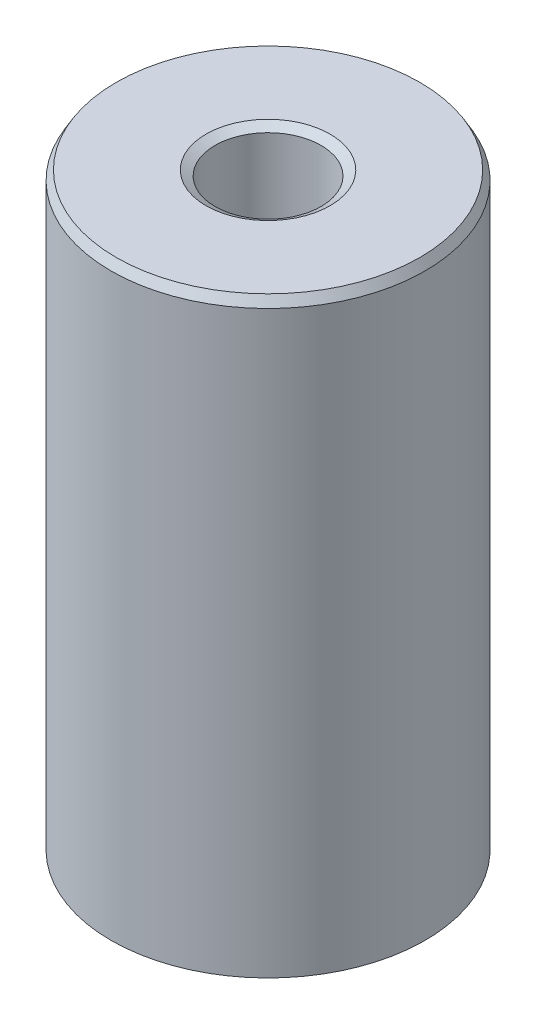
ISO-10303-21;
HEADER;
FILE_DESCRIPTION(('STEP AP214'),'2;1');
FILE_NAME('part.step','',(''),(''),'','','');
FILE_SCHEMA(('AUTOMOTIVE_DESIGN { 1 0 10303 214 1 1 1 1 }'));
ENDSEC;
DATA;
#1=APPLICATION_CONTEXT('core data for automotive mechanical design processes');
#2=APPLICATION_PROTOCOL_DEFINITION('international standard','automotive_design',2000,#1);
#3=PRODUCT_CONTEXT('',#1,'mechanical');
#4=PRODUCT('Part','Part','',(#3));
#5=PRODUCT_RELATED_PRODUCT_CATEGORY('part','',(#4));
#6=PRODUCT_DEFINITION_FORMATION('','',#4);
#7=PRODUCT_DEFINITION_CONTEXT('part definition',#1,'design');
#8=PRODUCT_DEFINITION('design','',#6,#7);
#9=PRODUCT_DEFINITION_SHAPE('','',#8);
#10=(LENGTH_UNIT() NAMED_UNIT(*) SI_UNIT(.MILLI.,.METRE.));
#11=(NAMED_UNIT(*) PLANE_ANGLE_UNIT() SI_UNIT($,.RADIAN.));
#12=(NAMED_UNIT(*) SI_UNIT($,.STERADIAN.) SOLID_ANGLE_UNIT());
#13=UNCERTAINTY_MEASURE_WITH_UNIT(LENGTH_MEASURE(1.E-05),#10,'distance_accuracy_value','');
#14=(GEOMETRIC_REPRESENTATION_CONTEXT(3) GLOBAL_UNCERTAINTY_ASSIGNED_CONTEXT((#13)) GLOBAL_UNIT_ASSIGNED_CONTEXT((#10,
#11,#12)) REPRESENTATION_CONTEXT('',''));
#15=CARTESIAN_POINT('',(0.,0.,0.));
#16=DIRECTION('',(0.,0.,1.));
#17=DIRECTION('',(1.,0.,0.));
#18=AXIS2_PLACEMENT_3D('',#15,#16,#17);
#19=CARTESIAN_POINT('',(0.,37.8421077277087,0.));
#20=DIRECTION('',(0.,-1.,0.));
#21=DIRECTION('',(0.,0.,-1.));
#22=AXIS2_PLACEMENT_3D('',#19,#20,#21);
#23=CYLINDRICAL_SURFACE('',#22,10.);
#24=CARTESIAN_POINT('',(0.,0.332499424557473,0.));
#25=DIRECTION('',(0.,1.,0.));
#26=DIRECTION('',(0.,0.,1.));
#27=AXIS2_PLACEMENT_3D('',#24,#25,#26);
#28=CIRCLE('',#27,10.);
#29=CARTESIAN_POINT('',(0.,0.332499424557473,10.));
#30=VERTEX_POINT('',#29);
#31=EDGE_CURVE('E10',#30,#30,#28,.T.);
#32=ORIENTED_EDGE('',*,*,#31,.T.);
#33=EDGE_LOOP('',(#32));
#34=FACE_BOUND('',#33,.T.);
#35=CARTESIAN_POINT('',(0.,37.2662018308877,0.));
#36=DIRECTION('',(0.,1.,0.));
#37=DIRECTION('',(0.,0.,1.));
#38=AXIS2_PLACEMENT_3D('',#35,#36,#37);
#39=CIRCLE('',#38,10.);
#40=CARTESIAN_POINT('',(0.,37.2662018308877,10.));
#41=VERTEX_POINT('',#40);
#42=EDGE_CURVE('E50',#41,#41,#39,.F.);
#43=ORIENTED_EDGE('',*,*,#42,.T.);
#44=EDGE_LOOP('',(#43));
#45=FACE_BOUND('',#44,.T.);
#46=ADVANCED_FACE('F39',(#34,#45),#23,.T.);
#47=CARTESIAN_POINT('',(0.,37.8421077277087,0.));
#48=DIRECTION('',(0.,1.,0.));
#49=DIRECTION('',(0.,0.,1.));
#50=AXIS2_PLACEMENT_3D('',#47,#48,#49);
#51=PLANE('',#50);
#52=CARTESIAN_POINT('',(0.,37.8421077277087,0.));
#53=DIRECTION('',(0.,1.,0.));
#54=DIRECTION('',(0.,0.,1.));
#55=AXIS2_PLACEMENT_3D('',#52,#53,#54);
#56=CIRCLE('',#55,3.95247798780841);
#57=CARTESIAN_POINT('',(0.,37.8421077277087,3.95247798780841));
#58=VERTEX_POINT('',#57);
#59=EDGE_CURVE('E58',#58,#58,#56,.F.);
#60=ORIENTED_EDGE('',*,*,#59,.T.);
#61=EDGE_LOOP('',(#60));
#62=FACE_BOUND('',#61,.T.);
#63=CARTESIAN_POINT('',(0.,37.8421077277087,0.));
#64=DIRECTION('',(0.,1.,0.));
#65=DIRECTION('',(0.,0.,1.));
#66=AXIS2_PLACEMENT_3D('',#63,#64,#65);
#67=CIRCLE('',#66,9.66750057544253);
#68=CARTESIAN_POINT('',(0.,37.8421077277087,9.66750057544253));
#69=VERTEX_POINT('',#68);
#70=EDGE_CURVE('E61',#69,#69,#67,.T.);
#71=ORIENTED_EDGE('',*,*,#70,.T.);
#72=EDGE_LOOP('',(#71));
#73=FACE_BOUND('',#72,.T.);
#74=ADVANCED_FACE('F88',(#62,#73),#51,.T.);
#75=CARTESIAN_POINT('',(0.,0.,0.));
#76=DIRECTION('',(0.,1.,0.));
#77=DIRECTION('',(0.,0.,1.));
#78=AXIS2_PLACEMENT_3D('',#75,#76,#77);
#79=PLANE('',#78);
#80=CARTESIAN_POINT('',(0.,0.,0.));
#81=DIRECTION('',(0.,1.,0.));
#82=DIRECTION('',(0.,0.,1.));
#83=AXIS2_PLACEMENT_3D('',#80,#81,#82);
#84=CIRCLE('',#83,3.70907151554493);
#85=CARTESIAN_POINT('',(0.,0.,3.70907151554493));
#86=VERTEX_POINT('',#85);
#87=EDGE_CURVE('E51',#86,#86,#84,.T.);
#88=ORIENTED_EDGE('',*,*,#87,.T.);
#89=EDGE_LOOP('',(#88));
#90=FACE_BOUND('',#89,.T.);
#91=CARTESIAN_POINT('',(0.,0.,0.));
#92=DIRECTION('',(0.,1.,0.));
#93=DIRECTION('',(0.,0.,1.));
#94=AXIS2_PLACEMENT_3D('',#91,#92,#93);
#95=CIRCLE('',#94,9.42409410317905);
#96=CARTESIAN_POINT('',(0.,0.,9.42409410317905));
#97=VERTEX_POINT('',#96);
#98=EDGE_CURVE('E54',#97,#97,#95,.F.);
#99=ORIENTED_EDGE('',*,*,#98,.T.);
#100=EDGE_LOOP('',(#99));
#101=FACE_BOUND('',#100,.T.);
#102=ADVANCED_FACE('F83',(#90,#101),#79,.F.);
#103=CARTESIAN_POINT('',(0.,37.8421077277087,0.));
#104=DIRECTION('',(0.,-1.,0.));
#105=DIRECTION('',(0.,0.,-1.));
#106=AXIS2_PLACEMENT_3D('',#103,#104,#105);
#107=CYLINDRICAL_SURFACE('',#106,3.37657209098747);
#108=CARTESIAN_POINT('',(0.,37.5096083031512,0.));
#109=DIRECTION('',(0.,1.,0.));
#110=DIRECTION('',(0.,0.,1.));
#111=AXIS2_PLACEMENT_3D('',#108,#109,#110);
#112=CIRCLE('',#111,3.37657209098747);
#113=CARTESIAN_POINT('',(0.,37.5096083031512,3.37657209098747));
#114=VERTEX_POINT('',#113);
#115=EDGE_CURVE('E67',#114,#114,#112,.T.);
#116=ORIENTED_EDGE('',*,*,#115,.T.);
#117=EDGE_LOOP('',(#116));
#118=FACE_BOUND('',#117,.T.);
#119=CARTESIAN_POINT('',(0.,0.575905896820945,0.));
#120=DIRECTION('',(0.,1.,0.));
#121=DIRECTION('',(0.,0.,1.));
#122=AXIS2_PLACEMENT_3D('',#119,#120,#121);
#123=CIRCLE('',#122,3.37657209098747);
#124=CARTESIAN_POINT('',(0.,0.575905896820945,3.37657209098747));
#125=VERTEX_POINT('',#124);
#126=EDGE_CURVE('E69',#125,#125,#123,.F.);
#127=ORIENTED_EDGE('',*,*,#126,.T.);
#128=EDGE_LOOP('',(#127));
#129=FACE_BOUND('',#128,.T.);
#130=ADVANCED_FACE('F71',(#118,#129),#107,.F.);
#131=CARTESIAN_POINT('',(0.,37.5096083031512,0.));
#132=DIRECTION('',(0.,1.,0.));
#133=DIRECTION('',(0.,0.,1.));
#134=AXIS2_PLACEMENT_3D('',#131,#132,#133);
#135=CONICAL_SURFACE('',#134,3.37657209098747,1.0471975511966);
#136=ORIENTED_EDGE('',*,*,#59,.F.);
#137=EDGE_LOOP('',(#136));
#138=FACE_BOUND('',#137,.T.);
#139=ORIENTED_EDGE('',*,*,#115,.F.);
#140=EDGE_LOOP('',(#139));
#141=FACE_BOUND('',#140,.T.);
#142=ADVANCED_FACE('F77',(#138,#141),#135,.F.);
#143=CARTESIAN_POINT('',(0.,0.,0.));
#144=DIRECTION('',(0.,-1.,0.));
#145=DIRECTION('',(0.,0.,-1.));
#146=AXIS2_PLACEMENT_3D('',#143,#144,#145);
#147=CONICAL_SURFACE('',#146,3.70907151554493,0.523598775598299);
#148=ORIENTED_EDGE('',*,*,#126,.F.);
#149=EDGE_LOOP('',(#148));
#150=FACE_BOUND('',#149,.T.);
#151=ORIENTED_EDGE('',*,*,#87,.F.);
#152=EDGE_LOOP('',(#151));
#153=FACE_BOUND('',#152,.T.);
#154=ADVANCED_FACE('F73',(#150,#153),#147,.F.);
#155=CARTESIAN_POINT('',(0.,0.332499424557473,0.));
#156=DIRECTION('',(0.,1.,0.));
#157=DIRECTION('',(0.,0.,1.));
#158=AXIS2_PLACEMENT_3D('',#155,#156,#157);
#159=CONICAL_SURFACE('',#158,10.,1.04719755119659);
#160=ORIENTED_EDGE('',*,*,#98,.F.);
#161=EDGE_LOOP('',(#160));
#162=FACE_BOUND('',#161,.T.);
#163=ORIENTED_EDGE('',*,*,#31,.F.);
#164=EDGE_LOOP('',(#163));
#165=FACE_BOUND('',#164,.T.);
#166=ADVANCED_FACE('F76',(#162,#165),#159,.T.);
#167=CARTESIAN_POINT('',(0.,37.8421077277087,0.));
#168=DIRECTION('',(0.,-1.,0.));
#169=DIRECTION('',(0.,0.,-1.));
#170=AXIS2_PLACEMENT_3D('',#167,#168,#169);
#171=CONICAL_SURFACE('',#170,9.66750057544253,0.523598775598293);
#172=ORIENTED_EDGE('',*,*,#42,.F.);
#173=EDGE_LOOP('',(#172));
#174=FACE_BOUND('',#173,.T.);
#175=ORIENTED_EDGE('',*,*,#70,.F.);
#176=EDGE_LOOP('',(#175));
#177=FACE_BOUND('',#176,.T.);
#178=ADVANCED_FACE('F45',(#174,#177),#171,.T.);
#179=CLOSED_SHELL('',(#46,#74,#102,#130,#142,#154,#166,#178));
#180=MANIFOLD_SOLID_BREP('B2',#179);
#181=ADVANCED_BREP_SHAPE_REPRESENTATION('',(#18,#180),#14);
#182=SHAPE_DEFINITION_REPRESENTATION(#9,#181);
ENDSEC;
END-ISO-10303-21;
